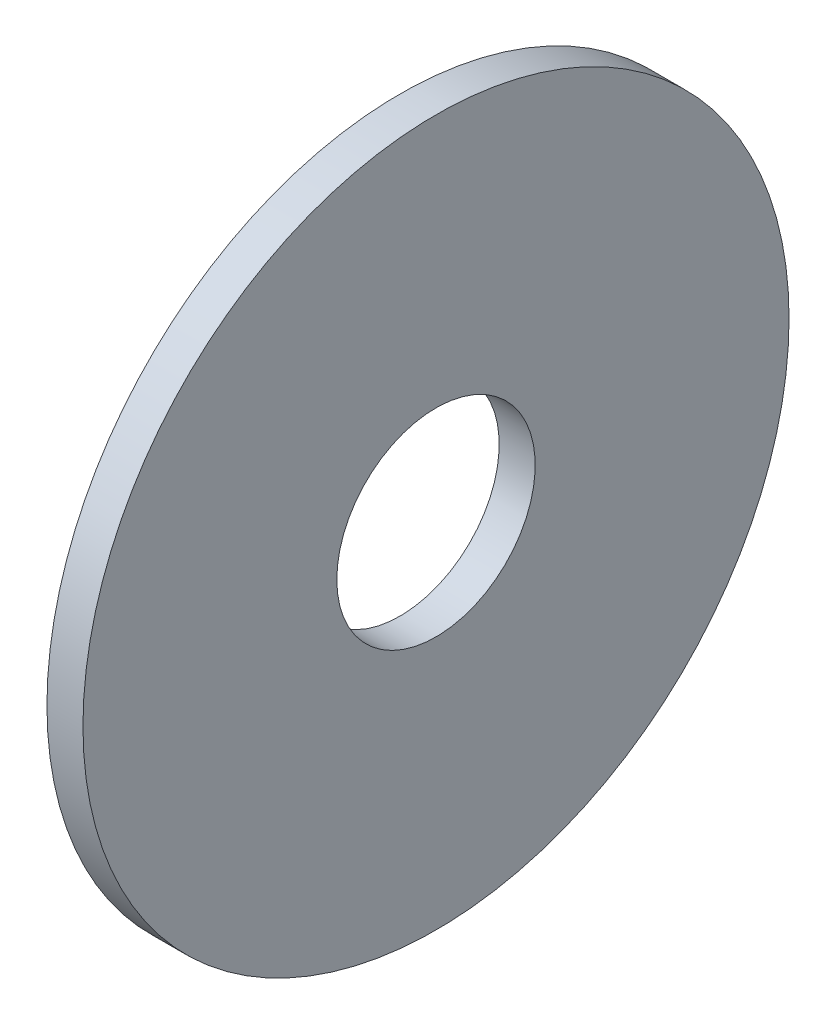
ISO-10303-21;
HEADER;
FILE_DESCRIPTION(('STEP AP214'),'2;1');
FILE_NAME('part.step','',(''),(''),'','','');
FILE_SCHEMA(('AUTOMOTIVE_DESIGN { 1 0 10303 214 1 1 1 1 }'));
ENDSEC;
DATA;
#1=APPLICATION_CONTEXT('core data for automotive mechanical design processes');
#2=APPLICATION_PROTOCOL_DEFINITION('international standard','automotive_design',2000,#1);
#3=PRODUCT_CONTEXT('',#1,'mechanical');
#4=PRODUCT('Part','Part','',(#3));
#5=PRODUCT_RELATED_PRODUCT_CATEGORY('part','',(#4));
#6=PRODUCT_DEFINITION_FORMATION('','',#4);
#7=PRODUCT_DEFINITION_CONTEXT('part definition',#1,'design');
#8=PRODUCT_DEFINITION('design','',#6,#7);
#9=PRODUCT_DEFINITION_SHAPE('','',#8);
#10=(LENGTH_UNIT() NAMED_UNIT(*) SI_UNIT(.MILLI.,.METRE.));
#11=(NAMED_UNIT(*) PLANE_ANGLE_UNIT() SI_UNIT($,.RADIAN.));
#12=(NAMED_UNIT(*) SI_UNIT($,.STERADIAN.) SOLID_ANGLE_UNIT());
#13=UNCERTAINTY_MEASURE_WITH_UNIT(LENGTH_MEASURE(1.E-05),#10,'distance_accuracy_value','');
#14=(GEOMETRIC_REPRESENTATION_CONTEXT(3) GLOBAL_UNCERTAINTY_ASSIGNED_CONTEXT((#13)) GLOBAL_UNIT_ASSIGNED_CONTEXT((#10,
#11,#12)) REPRESENTATION_CONTEXT('',''));
#15=CARTESIAN_POINT('',(0.,0.,0.));
#16=DIRECTION('',(0.,0.,1.));
#17=DIRECTION('',(1.,0.,0.));
#18=AXIS2_PLACEMENT_3D('',#15,#16,#17);
#19=CARTESIAN_POINT('',(0.,0.,0.));
#20=DIRECTION('',(1.,0.,0.));
#21=DIRECTION('',(0.,0.,-1.));
#22=AXIS2_PLACEMENT_3D('',#19,#20,#21);
#23=PLANE('',#22);
#24=CARTESIAN_POINT('',(0.,0.,0.));
#25=DIRECTION('',(-1.,0.,0.));
#26=DIRECTION('',(0.,0.,1.));
#27=AXIS2_PLACEMENT_3D('',#24,#25,#26);
#28=CIRCLE('',#27,3.5687);
#29=CARTESIAN_POINT('',(0.,0.,3.5687));
#30=VERTEX_POINT('',#29);
#31=EDGE_CURVE('E27',#30,#30,#28,.F.);
#32=ORIENTED_EDGE('',*,*,#31,.T.);
#33=EDGE_LOOP('',(#32));
#34=FACE_BOUND('',#33,.T.);
#35=CARTESIAN_POINT('',(0.,0.,0.));
#36=DIRECTION('',(-1.,0.,0.));
#37=DIRECTION('',(0.,0.,1.));
#38=AXIS2_PLACEMENT_3D('',#35,#36,#37);
#39=CIRCLE('',#38,12.7);
#40=CARTESIAN_POINT('',(0.,0.,12.7));
#41=VERTEX_POINT('',#40);
#42=EDGE_CURVE('E18',#41,#41,#39,.F.);
#43=ORIENTED_EDGE('',*,*,#42,.F.);
#44=EDGE_LOOP('',(#43));
#45=FACE_BOUND('',#44,.T.);
#46=ADVANCED_FACE('F15',(#34,#45),#23,.F.);
#47=CARTESIAN_POINT('',(1.2954,0.,0.));
#48=DIRECTION('',(-1.,0.,0.));
#49=DIRECTION('',(0.,0.,1.));
#50=AXIS2_PLACEMENT_3D('',#47,#48,#49);
#51=CYLINDRICAL_SURFACE('',#50,12.7);
#52=ORIENTED_EDGE('',*,*,#42,.T.);
#53=EDGE_LOOP('',(#52));
#54=FACE_BOUND('',#53,.T.);
#55=CARTESIAN_POINT('',(1.2954,0.,0.));
#56=DIRECTION('',(-1.,0.,0.));
#57=DIRECTION('',(0.,0.,1.));
#58=AXIS2_PLACEMENT_3D('',#55,#56,#57);
#59=CIRCLE('',#58,12.7);
#60=CARTESIAN_POINT('',(1.2954,0.,12.7));
#61=VERTEX_POINT('',#60);
#62=EDGE_CURVE('E22',#61,#61,#59,.F.);
#63=ORIENTED_EDGE('',*,*,#62,.F.);
#64=EDGE_LOOP('',(#63));
#65=FACE_BOUND('',#64,.T.);
#66=ADVANCED_FACE('F35',(#54,#65),#51,.T.);
#67=CARTESIAN_POINT('',(1.2954,0.,0.));
#68=DIRECTION('',(-1.,0.,0.));
#69=DIRECTION('',(0.,0.,1.));
#70=AXIS2_PLACEMENT_3D('',#67,#68,#69);
#71=CYLINDRICAL_SURFACE('',#70,3.5687);
#72=CARTESIAN_POINT('',(1.2954,0.,0.));
#73=DIRECTION('',(-1.,0.,0.));
#74=DIRECTION('',(0.,0.,1.));
#75=AXIS2_PLACEMENT_3D('',#72,#73,#74);
#76=CIRCLE('',#75,3.5687);
#77=CARTESIAN_POINT('',(1.2954,0.,3.5687));
#78=VERTEX_POINT('',#77);
#79=EDGE_CURVE('E10',#78,#78,#76,.T.);
#80=ORIENTED_EDGE('',*,*,#79,.F.);
#81=EDGE_LOOP('',(#80));
#82=FACE_BOUND('',#81,.T.);
#83=ORIENTED_EDGE('',*,*,#31,.F.);
#84=EDGE_LOOP('',(#83));
#85=FACE_BOUND('',#84,.T.);
#86=ADVANCED_FACE('F43',(#82,#85),#71,.F.);
#87=CARTESIAN_POINT('',(1.2954,0.,0.));
#88=DIRECTION('',(1.,0.,0.));
#89=DIRECTION('',(0.,0.,-1.));
#90=AXIS2_PLACEMENT_3D('',#87,#88,#89);
#91=PLANE('',#90);
#92=ORIENTED_EDGE('',*,*,#79,.T.);
#93=EDGE_LOOP('',(#92));
#94=FACE_BOUND('',#93,.T.);
#95=ORIENTED_EDGE('',*,*,#62,.T.);
#96=EDGE_LOOP('',(#95));
#97=FACE_BOUND('',#96,.T.);
#98=ADVANCED_FACE('F44',(#94,#97),#91,.T.);
#99=CLOSED_SHELL('',(#46,#66,#86,#98));
#100=MANIFOLD_SOLID_BREP('B1',#99);
#101=ADVANCED_BREP_SHAPE_REPRESENTATION('',(#18,#100),#14);
#102=SHAPE_DEFINITION_REPRESENTATION(#9,#101);
ENDSEC;
END-ISO-10303-21;
